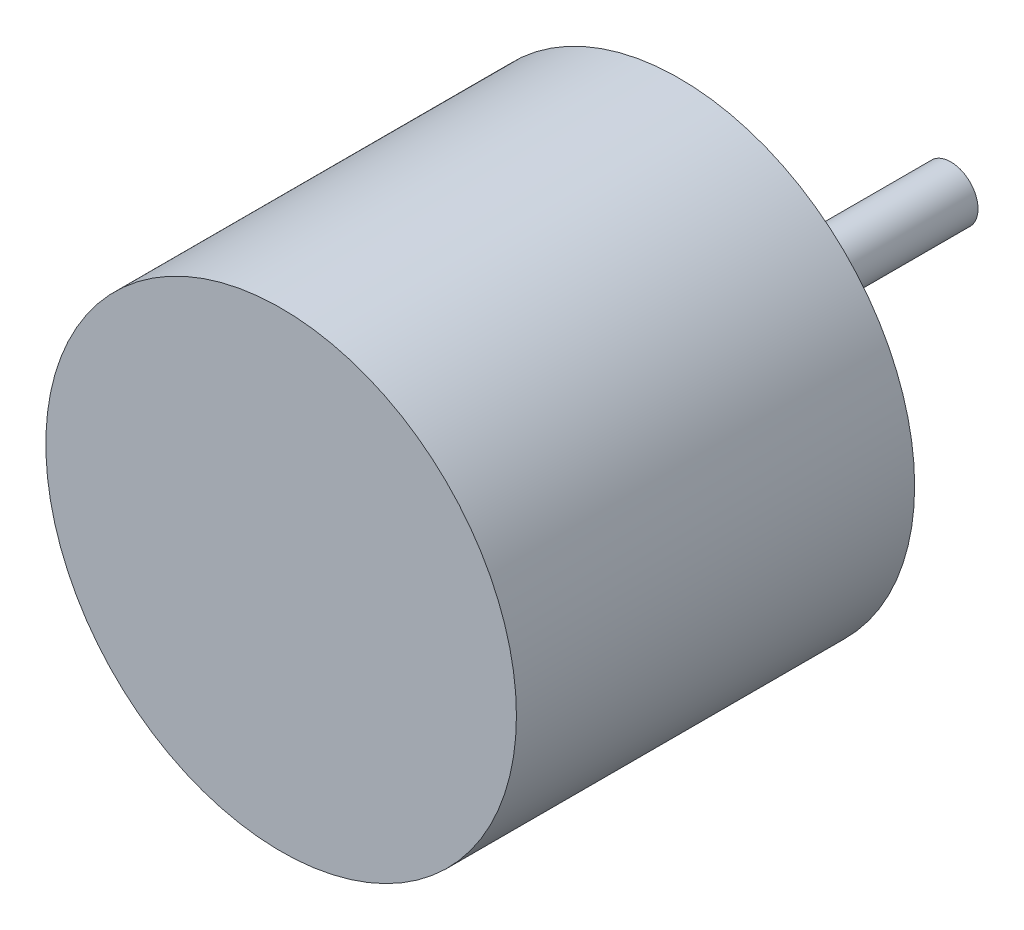
ISO-10303-21;
HEADER;
FILE_DESCRIPTION(('STEP AP214'),'2;1');
FILE_NAME('part.step','',(''),(''),'','','');
FILE_SCHEMA(('AUTOMOTIVE_DESIGN { 1 0 10303 214 1 1 1 1 }'));
ENDSEC;
DATA;
#1=APPLICATION_CONTEXT('core data for automotive mechanical design processes');
#2=APPLICATION_PROTOCOL_DEFINITION('international standard','automotive_design',2000,#1);
#3=PRODUCT_CONTEXT('',#1,'mechanical');
#4=PRODUCT('Part','Part','',(#3));
#5=PRODUCT_RELATED_PRODUCT_CATEGORY('part','',(#4));
#6=PRODUCT_DEFINITION_FORMATION('','',#4);
#7=PRODUCT_DEFINITION_CONTEXT('part definition',#1,'design');
#8=PRODUCT_DEFINITION('design','',#6,#7);
#9=PRODUCT_DEFINITION_SHAPE('','',#8);
#10=(LENGTH_UNIT() NAMED_UNIT(*) SI_UNIT(.MILLI.,.METRE.));
#11=(NAMED_UNIT(*) PLANE_ANGLE_UNIT() SI_UNIT($,.RADIAN.));
#12=(NAMED_UNIT(*) SI_UNIT($,.STERADIAN.) SOLID_ANGLE_UNIT());
#13=UNCERTAINTY_MEASURE_WITH_UNIT(LENGTH_MEASURE(1.E-05),#10,'distance_accuracy_value','');
#14=(GEOMETRIC_REPRESENTATION_CONTEXT(3) GLOBAL_UNCERTAINTY_ASSIGNED_CONTEXT((#13)) GLOBAL_UNIT_ASSIGNED_CONTEXT((#10,
#11,#12)) REPRESENTATION_CONTEXT('',''));
#15=CARTESIAN_POINT('',(0.,0.,0.));
#16=DIRECTION('',(0.,0.,1.));
#17=DIRECTION('',(1.,0.,0.));
#18=AXIS2_PLACEMENT_3D('',#15,#16,#17);
#19=CARTESIAN_POINT('',(0.,0.,22.));
#20=DIRECTION('',(0.,0.,-1.));
#21=DIRECTION('',(-1.,0.,0.));
#22=AXIS2_PLACEMENT_3D('',#19,#20,#21);
#23=CYLINDRICAL_SURFACE('',#22,13.);
#24=CARTESIAN_POINT('',(0.,0.,22.));
#25=DIRECTION('',(0.,0.,1.));
#26=DIRECTION('',(1.,0.,0.));
#27=AXIS2_PLACEMENT_3D('',#24,#25,#26);
#28=CIRCLE('',#27,13.);
#29=CARTESIAN_POINT('',(13.,0.,22.));
#30=VERTEX_POINT('',#29);
#31=EDGE_CURVE('E39',#30,#30,#28,.T.);
#32=ORIENTED_EDGE('',*,*,#31,.F.);
#33=EDGE_LOOP('',(#32));
#34=FACE_BOUND('',#33,.T.);
#35=CARTESIAN_POINT('',(0.,0.,0.));
#36=DIRECTION('',(0.,0.,1.));
#37=DIRECTION('',(1.,0.,0.));
#38=AXIS2_PLACEMENT_3D('',#35,#36,#37);
#39=CIRCLE('',#38,13.);
#40=CARTESIAN_POINT('',(13.,0.,0.));
#41=VERTEX_POINT('',#40);
#42=EDGE_CURVE('E43',#41,#41,#39,.T.);
#43=ORIENTED_EDGE('',*,*,#42,.T.);
#44=EDGE_LOOP('',(#43));
#45=FACE_BOUND('',#44,.T.);
#46=ADVANCED_FACE('F33',(#34,#45),#23,.T.);
#47=CARTESIAN_POINT('',(0.,0.,22.));
#48=DIRECTION('',(0.,0.,1.));
#49=DIRECTION('',(1.,0.,0.));
#50=AXIS2_PLACEMENT_3D('',#47,#48,#49);
#51=PLANE('',#50);
#52=ORIENTED_EDGE('',*,*,#31,.T.);
#53=EDGE_LOOP('',(#52));
#54=FACE_BOUND('',#53,.T.);
#55=ADVANCED_FACE('F64',(#54),#51,.T.);
#56=CARTESIAN_POINT('',(0.,0.,0.));
#57=DIRECTION('',(0.,0.,1.));
#58=DIRECTION('',(1.,0.,0.));
#59=AXIS2_PLACEMENT_3D('',#56,#57,#58);
#60=PLANE('',#59);
#61=CARTESIAN_POINT('',(0.,0.,0.));
#62=DIRECTION('',(0.,0.,1.));
#63=DIRECTION('',(1.,0.,0.));
#64=AXIS2_PLACEMENT_3D('',#61,#62,#63);
#65=CIRCLE('',#64,1.5);
#66=CARTESIAN_POINT('',(1.5,0.,0.));
#67=VERTEX_POINT('',#66);
#68=EDGE_CURVE('E10',#67,#67,#65,.F.);
#69=ORIENTED_EDGE('',*,*,#68,.F.);
#70=EDGE_LOOP('',(#69));
#71=FACE_BOUND('',#70,.T.);
#72=ORIENTED_EDGE('',*,*,#42,.F.);
#73=EDGE_LOOP('',(#72));
#74=FACE_BOUND('',#73,.T.);
#75=ADVANCED_FACE('F57',(#71,#74),#60,.F.);
#76=CARTESIAN_POINT('',(0.,0.,-15.));
#77=DIRECTION('',(0.,0.,1.));
#78=DIRECTION('',(1.,0.,0.));
#79=AXIS2_PLACEMENT_3D('',#76,#77,#78);
#80=CYLINDRICAL_SURFACE('',#79,1.5);
#81=CARTESIAN_POINT('',(0.,0.,-15.));
#82=DIRECTION('',(0.,0.,-1.));
#83=DIRECTION('',(-1.,0.,0.));
#84=AXIS2_PLACEMENT_3D('',#81,#82,#83);
#85=CIRCLE('',#84,1.5);
#86=CARTESIAN_POINT('',(-1.5,0.,-15.));
#87=VERTEX_POINT('',#86);
#88=EDGE_CURVE('E48',#87,#87,#85,.T.);
#89=ORIENTED_EDGE('',*,*,#88,.F.);
#90=EDGE_LOOP('',(#89));
#91=FACE_BOUND('',#90,.T.);
#92=ORIENTED_EDGE('',*,*,#68,.T.);
#93=EDGE_LOOP('',(#92));
#94=FACE_BOUND('',#93,.T.);
#95=ADVANCED_FACE('F55',(#91,#94),#80,.T.);
#96=CARTESIAN_POINT('',(0.,0.,-15.));
#97=DIRECTION('',(0.,0.,-1.));
#98=DIRECTION('',(-1.,0.,0.));
#99=AXIS2_PLACEMENT_3D('',#96,#97,#98);
#100=PLANE('',#99);
#101=ORIENTED_EDGE('',*,*,#88,.T.);
#102=EDGE_LOOP('',(#101));
#103=FACE_BOUND('',#102,.T.);
#104=ADVANCED_FACE('F53',(#103),#100,.T.);
#105=CLOSED_SHELL('',(#46,#55,#75,#95,#104));
#106=MANIFOLD_SOLID_BREP('B2',#105);
#107=ADVANCED_BREP_SHAPE_REPRESENTATION('',(#18,#106),#14);
#108=SHAPE_DEFINITION_REPRESENTATION(#9,#107);
ENDSEC;
END-ISO-10303-21;
